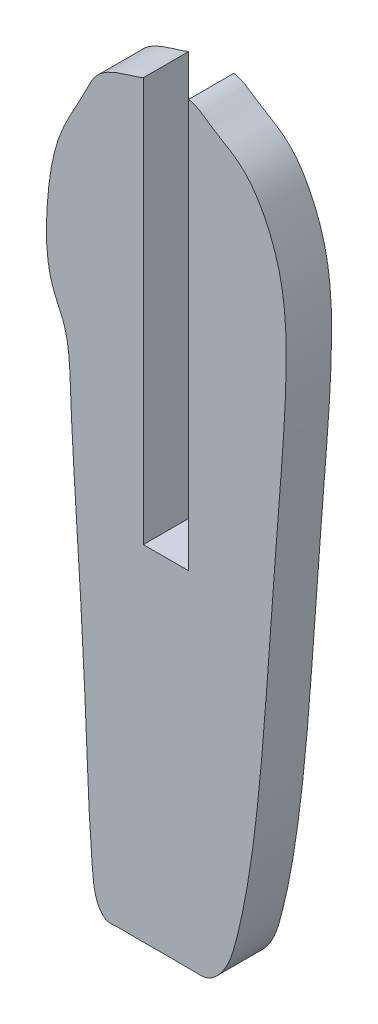
ISO-10303-21;
HEADER;
FILE_DESCRIPTION(('STEP AP214'),'2;1');
FILE_NAME('part.step','',(''),(''),'','','');
FILE_SCHEMA(('AUTOMOTIVE_DESIGN { 1 0 10303 214 1 1 1 1 }'));
ENDSEC;
DATA;
#1=APPLICATION_CONTEXT('core data for automotive mechanical design processes');
#2=APPLICATION_PROTOCOL_DEFINITION('international standard','automotive_design',2000,#1);
#3=PRODUCT_CONTEXT('',#1,'mechanical');
#4=PRODUCT('Part','Part','',(#3));
#5=PRODUCT_RELATED_PRODUCT_CATEGORY('part','',(#4));
#6=PRODUCT_DEFINITION_FORMATION('','',#4);
#7=PRODUCT_DEFINITION_CONTEXT('part definition',#1,'design');
#8=PRODUCT_DEFINITION('design','',#6,#7);
#9=PRODUCT_DEFINITION_SHAPE('','',#8);
#10=(LENGTH_UNIT() NAMED_UNIT(*) SI_UNIT(.MILLI.,.METRE.));
#11=(NAMED_UNIT(*) PLANE_ANGLE_UNIT() SI_UNIT($,.RADIAN.));
#12=(NAMED_UNIT(*) SI_UNIT($,.STERADIAN.) SOLID_ANGLE_UNIT());
#13=UNCERTAINTY_MEASURE_WITH_UNIT(LENGTH_MEASURE(1.E-05),#10,'distance_accuracy_value','');
#14=(GEOMETRIC_REPRESENTATION_CONTEXT(3) GLOBAL_UNCERTAINTY_ASSIGNED_CONTEXT((#13)) GLOBAL_UNIT_ASSIGNED_CONTEXT((#10,
#11,#12)) REPRESENTATION_CONTEXT('',''));
#15=CARTESIAN_POINT('',(0.,0.,0.));
#16=DIRECTION('',(0.,0.,1.));
#17=DIRECTION('',(1.,0.,0.));
#18=AXIS2_PLACEMENT_3D('',#15,#16,#17);
#19=CARTESIAN_POINT('',(0.,-33.4574468085106,3.));
#20=CARTESIAN_POINT('',(0.476348767302769,-33.4612247823282,3.));
#21=CARTESIAN_POINT('',(1.1176983493128,-33.4577393510762,3.));
#22=CARTESIAN_POINT('',(2.15503925955124,-33.4568910596859,3.));
#23=CARTESIAN_POINT('',(2.72816559040753,-33.4864696247628,3.));
#24=CARTESIAN_POINT('',(3.65743541335635,-33.4230162190586,3.));
#25=CARTESIAN_POINT('',(4.77562538195093,-32.3038594847888,3.));
#26=CARTESIAN_POINT('',(5.82092603679563,-28.7487394612256,3.));
#27=CARTESIAN_POINT('',(6.95842819985669,-21.3735511033142,3.));
#28=CARTESIAN_POINT('',(7.53437242776158,-11.8537262782267,3.));
#29=CARTESIAN_POINT('',(8.28110745463819,-2.67408545499112,3.));
#30=CARTESIAN_POINT('',(8.73391512506526,3.81896264099834,3.));
#31=CARTESIAN_POINT('',(8.55157388632817,8.67255674488477,3.));
#32=CARTESIAN_POINT('',(7.37462828310868,12.0629825252676,3.));
#33=CARTESIAN_POINT('',(5.77496878670363,14.3545765483316,3.));
#34=CARTESIAN_POINT('',(3.37996516012665,15.5593556143804,3.));
#35=CARTESIAN_POINT('',(2.96311853199113,16.0866273097871,3.));
#36=CARTESIAN_POINT('',(2.20000000000001,16.2798861410953,3.));
#37=B_SPLINE_CURVE_WITH_KNOTS('',3,(#19,#20,#21,#22,#23,#24,#25,#26,#27,#28,#29,#30,#31,#32,#33,
#34,#35,#36),.UNSPECIFIED.,.F.,.F.,(4,1,1,1,1,1,1,1,1,1,1,1,1,1,1,4),(0.0259345926958942,
0.0524415128520202,0.0577686580603061,0.0768241129211479,0.0819555049008668,0.10670064599989,
0.145840566481924,0.274335938690583,0.483714769232246,0.634600312495663,0.744507152818127,
0.816414004946962,0.881335872173313,0.923856158488981,0.959751805177799,1.),.UNSPECIFIED.);
#38=DIRECTION('',(0.,0.,-1.));
#39=VECTOR('',#38,1.);
#40=SURFACE_OF_LINEAR_EXTRUSION('',#37,#39);
#41=CARTESIAN_POINT('',(0.,-33.4574468085106,0.));
#42=CARTESIAN_POINT('',(0.476348767302769,-33.4612247823282,0.));
#43=CARTESIAN_POINT('',(1.1176983493128,-33.4577393510762,0.));
#44=CARTESIAN_POINT('',(2.15503925955124,-33.4568910596859,0.));
#45=CARTESIAN_POINT('',(2.72816559040753,-33.4864696247628,0.));
#46=CARTESIAN_POINT('',(3.65743541335635,-33.4230162190586,0.));
#47=CARTESIAN_POINT('',(4.77562538195093,-32.3038594847888,0.));
#48=CARTESIAN_POINT('',(5.82092603679563,-28.7487394612256,0.));
#49=CARTESIAN_POINT('',(6.95842819985669,-21.3735511033142,0.));
#50=CARTESIAN_POINT('',(7.53437242776158,-11.8537262782267,0.));
#51=CARTESIAN_POINT('',(8.28110745463819,-2.67408545499112,0.));
#52=CARTESIAN_POINT('',(8.73391512506526,3.81896264099834,0.));
#53=CARTESIAN_POINT('',(8.55157388632817,8.67255674488477,0.));
#54=CARTESIAN_POINT('',(7.37462828310868,12.0629825252676,0.));
#55=CARTESIAN_POINT('',(5.77496878670363,14.3545765483316,0.));
#56=CARTESIAN_POINT('',(3.37996516012665,15.5593556143804,0.));
#57=CARTESIAN_POINT('',(2.96311853199113,16.0866273097871,0.));
#58=CARTESIAN_POINT('',(2.20000000000001,16.2798861410953,0.));
#59=B_SPLINE_CURVE_WITH_KNOTS('',3,(#41,#42,#43,#44,#45,#46,#47,#48,#49,#50,#51,#52,#53,#54,#55,
#56,#57,#58),.UNSPECIFIED.,.F.,.F.,(4,1,1,1,1,1,1,1,1,1,1,1,1,1,1,4),(0.0259345926958942,
0.0524415128520202,0.0577686580603061,0.0768241129211479,0.0819555049008668,0.10670064599989,
0.145840566481924,0.274335938690583,0.483714769232246,0.634600312495663,0.744507152818127,
0.816414004946962,0.881335872173313,0.923856158488981,0.959751805177799,1.),.UNSPECIFIED.);
#60=CARTESIAN_POINT('',(0.,-33.4574468085106,0.));
#61=VERTEX_POINT('',#60);
#62=CARTESIAN_POINT('',(2.20000000000001,16.2798861410953,0.));
#63=VERTEX_POINT('',#62);
#64=EDGE_CURVE('E111',#61,#63,#59,.T.);
#65=ORIENTED_EDGE('',*,*,#64,.T.);
#66=DIRECTION('',(0.,0.,-1.));
#67=VECTOR('',#66,1.);
#68=CARTESIAN_POINT('',(2.20000000000001,16.2798861410953,3.));
#69=LINE('',#68,#67);
#70=CARTESIAN_POINT('',(2.20000000000001,16.2798861410953,3.));
#71=VERTEX_POINT('',#70);
#72=EDGE_CURVE('E11',#71,#63,#69,.T.);
#73=ORIENTED_EDGE('',*,*,#72,.F.);
#74=CARTESIAN_POINT('',(0.,-33.4574468085106,3.));
#75=VERTEX_POINT('',#74);
#76=EDGE_CURVE('E145',#75,#71,#37,.T.);
#77=ORIENTED_EDGE('',*,*,#76,.F.);
#78=DIRECTION('',(0.,0.,-1.));
#79=VECTOR('',#78,1.);
#80=CARTESIAN_POINT('',(0.,-33.4574468085106,3.));
#81=LINE('',#80,#79);
#82=EDGE_CURVE('E104',#75,#61,#81,.T.);
#83=ORIENTED_EDGE('',*,*,#82,.T.);
#84=EDGE_LOOP('',(#65,#73,#77,#83));
#85=FACE_BOUND('',#84,.T.);
#86=ADVANCED_FACE('F33',(#85),#40,.F.);
#87=CARTESIAN_POINT('',(2.20000000000001,16.2798861410953,3.));
#88=DIRECTION('',(1.,0.,0.));
#89=DIRECTION('',(0.,1.,0.));
#90=AXIS2_PLACEMENT_3D('',#87,#88,#89);
#91=PLANE('',#90);
#92=DIRECTION('',(0.,-1.,0.));
#93=VECTOR('',#92,1.);
#94=CARTESIAN_POINT('',(2.20000000000001,16.2798861410953,0.));
#95=LINE('',#94,#93);
#96=CARTESIAN_POINT('',(2.20000000000001,-10.7087610491027,0.));
#97=VERTEX_POINT('',#96);
#98=EDGE_CURVE('E134',#63,#97,#95,.T.);
#99=ORIENTED_EDGE('',*,*,#98,.T.);
#100=DIRECTION('',(0.,0.,-1.));
#101=VECTOR('',#100,1.);
#102=CARTESIAN_POINT('',(2.20000000000001,-10.7087610491027,3.));
#103=LINE('',#102,#101);
#104=CARTESIAN_POINT('',(2.20000000000001,-10.7087610491027,3.));
#105=VERTEX_POINT('',#104);
#106=EDGE_CURVE('E42',#105,#97,#103,.T.);
#107=ORIENTED_EDGE('',*,*,#106,.F.);
#108=DIRECTION('',(0.,-1.,0.));
#109=VECTOR('',#108,1.);
#110=CARTESIAN_POINT('',(2.20000000000001,16.2798861410953,3.));
#111=LINE('',#110,#109);
#112=EDGE_CURVE('E84',#71,#105,#111,.T.);
#113=ORIENTED_EDGE('',*,*,#112,.F.);
#114=ORIENTED_EDGE('',*,*,#72,.T.);
#115=EDGE_LOOP('',(#99,#107,#113,#114));
#116=FACE_BOUND('',#115,.T.);
#117=ADVANCED_FACE('F128',(#116),#91,.F.);
#118=CARTESIAN_POINT('',(2.20000000000001,-10.7087610491027,3.));
#119=DIRECTION('',(0.,-1.,0.));
#120=DIRECTION('',(0.,0.,-1.));
#121=AXIS2_PLACEMENT_3D('',#118,#119,#120);
#122=PLANE('',#121);
#123=DIRECTION('',(-1.,0.,0.));
#124=VECTOR('',#123,1.);
#125=CARTESIAN_POINT('',(2.20000000000001,-10.7087610491027,0.));
#126=LINE('',#125,#124);
#127=CARTESIAN_POINT('',(-0.799999999999994,-10.7087610491027,0.));
#128=VERTEX_POINT('',#127);
#129=EDGE_CURVE('E99',#97,#128,#126,.T.);
#130=ORIENTED_EDGE('',*,*,#129,.T.);
#131=DIRECTION('',(0.,0.,-1.));
#132=VECTOR('',#131,1.);
#133=CARTESIAN_POINT('',(-0.799999999999994,-10.7087610491027,3.));
#134=LINE('',#133,#132);
#135=CARTESIAN_POINT('',(-0.799999999999994,-10.7087610491027,3.));
#136=VERTEX_POINT('',#135);
#137=EDGE_CURVE('E96',#136,#128,#134,.T.);
#138=ORIENTED_EDGE('',*,*,#137,.F.);
#139=DIRECTION('',(-1.,0.,0.));
#140=VECTOR('',#139,1.);
#141=CARTESIAN_POINT('',(2.20000000000001,-10.7087610491027,3.));
#142=LINE('',#141,#140);
#143=EDGE_CURVE('E88',#105,#136,#142,.T.);
#144=ORIENTED_EDGE('',*,*,#143,.F.);
#145=ORIENTED_EDGE('',*,*,#106,.T.);
#146=EDGE_LOOP('',(#130,#138,#144,#145));
#147=FACE_BOUND('',#146,.T.);
#148=ADVANCED_FACE('F97',(#147),#122,.F.);
#149=CARTESIAN_POINT('',(-0.799999999999994,-10.7087610491027,3.));
#150=DIRECTION('',(-1.,0.,0.));
#151=DIRECTION('',(0.,0.,1.));
#152=AXIS2_PLACEMENT_3D('',#149,#150,#151);
#153=PLANE('',#152);
#154=DIRECTION('',(0.,1.,0.));
#155=VECTOR('',#154,1.);
#156=CARTESIAN_POINT('',(-0.799999999999994,-10.7087610491027,0.));
#157=LINE('',#156,#155);
#158=CARTESIAN_POINT('',(-0.799999999999994,16.0185811023616,0.));
#159=VERTEX_POINT('',#158);
#160=EDGE_CURVE('E70',#128,#159,#157,.T.);
#161=ORIENTED_EDGE('',*,*,#160,.T.);
#162=DIRECTION('',(0.,0.,-1.));
#163=VECTOR('',#162,1.);
#164=CARTESIAN_POINT('',(-0.799999999999994,16.0185811023616,3.));
#165=LINE('',#164,#163);
#166=CARTESIAN_POINT('',(-0.799999999999994,16.0185811023616,3.));
#167=VERTEX_POINT('',#166);
#168=EDGE_CURVE('E100',#167,#159,#165,.T.);
#169=ORIENTED_EDGE('',*,*,#168,.F.);
#170=DIRECTION('',(0.,1.,0.));
#171=VECTOR('',#170,1.);
#172=CARTESIAN_POINT('',(-0.799999999999994,-10.7087610491027,3.));
#173=LINE('',#172,#171);
#174=EDGE_CURVE('E92',#136,#167,#173,.T.);
#175=ORIENTED_EDGE('',*,*,#174,.F.);
#176=ORIENTED_EDGE('',*,*,#137,.T.);
#177=EDGE_LOOP('',(#161,#169,#175,#176));
#178=FACE_BOUND('',#177,.T.);
#179=ADVANCED_FACE('F102',(#178),#153,.F.);
#180=CARTESIAN_POINT('',(-0.799999999999994,16.0185811023616,3.));
#181=CARTESIAN_POINT('',(-1.13747886836467,15.856785997049,3.));
#182=CARTESIAN_POINT('',(-3.86496892757496,15.1866053329434,3.));
#183=CARTESIAN_POINT('',(-4.46434574190813,13.3770219147037,3.));
#184=CARTESIAN_POINT('',(-6.53048239301621,10.1604946445765,3.));
#185=CARTESIAN_POINT('',(-7.09628317577196,6.81545614126418,3.));
#186=CARTESIAN_POINT('',(-7.27673344555765,3.64996002874281,3.));
#187=CARTESIAN_POINT('',(-7.01026939846662,1.22207344535776,3.));
#188=CARTESIAN_POINT('',(-6.03857588775107,-0.500882296728355,3.));
#189=CARTESIAN_POINT('',(-5.67231537393509,-2.24841790875321,3.));
#190=CARTESIAN_POINT('',(-5.57604990103804,-5.96414366824389,3.));
#191=CARTESIAN_POINT('',(-5.12130196910531,-12.7482248871357,3.));
#192=CARTESIAN_POINT('',(-4.58695894064424,-21.7776768656014,3.));
#193=CARTESIAN_POINT('',(-4.39832374762056,-28.5425563165297,3.));
#194=CARTESIAN_POINT('',(-4.01051322097913,-32.4939682558477,3.));
#195=CARTESIAN_POINT('',(-3.49287857583255,-33.5811798853354,3.));
#196=CARTESIAN_POINT('',(-2.48219226750682,-33.4322900300388,3.));
#197=CARTESIAN_POINT('',(-1.97549097245365,-33.45361621554,3.));
#198=CARTESIAN_POINT('',(-1.14300381807501,-33.4665525346081,3.));
#199=CARTESIAN_POINT('',(-0.59611319228943,-33.4776102309238,3.));
#200=CARTESIAN_POINT('',(0.,-33.4574468085106,3.));
#201=B_SPLINE_CURVE_WITH_KNOTS('',3,(#180,#181,#182,#183,#184,#185,#186,#187,#188,#189,#190,
#191,#192,#193,#194,#195,#196,#197,#198,#199,#200),.UNSPECIFIED.,.F.,.F.,(4,1,1,1,1,1,1,1,1,1,1,
1,1,1,1,1,1,1,4),(0.0272532463485994,0.0465589411504237,0.0963849330344887,0.158729392728825,
0.22818560391023,0.271981862516655,0.323080185279998,0.351299809078383,0.373137696715846,
0.414663231050136,0.543428446795852,0.725126088508359,0.882497071981521,0.894014183003315,
0.929959463539118,0.943400874248894,0.960682688018606,0.966342600593716,1.),.UNSPECIFIED.);
#202=DIRECTION('',(0.,0.,-1.));
#203=VECTOR('',#202,1.);
#204=SURFACE_OF_LINEAR_EXTRUSION('',#201,#203);
#205=CARTESIAN_POINT('',(-0.799999999999994,16.0185811023616,0.));
#206=CARTESIAN_POINT('',(-1.13747886836467,15.856785997049,0.));
#207=CARTESIAN_POINT('',(-3.86496892757496,15.1866053329434,0.));
#208=CARTESIAN_POINT('',(-4.46434574190813,13.3770219147037,0.));
#209=CARTESIAN_POINT('',(-6.53048239301621,10.1604946445765,0.));
#210=CARTESIAN_POINT('',(-7.09628317577196,6.81545614126418,0.));
#211=CARTESIAN_POINT('',(-7.27673344555765,3.64996002874281,0.));
#212=CARTESIAN_POINT('',(-7.01026939846662,1.22207344535776,0.));
#213=CARTESIAN_POINT('',(-6.03857588775107,-0.500882296728355,0.));
#214=CARTESIAN_POINT('',(-5.67231537393509,-2.24841790875321,0.));
#215=CARTESIAN_POINT('',(-5.57604990103804,-5.96414366824389,0.));
#216=CARTESIAN_POINT('',(-5.12130196910531,-12.7482248871357,0.));
#217=CARTESIAN_POINT('',(-4.58695894064424,-21.7776768656014,0.));
#218=CARTESIAN_POINT('',(-4.39832374762056,-28.5425563165297,0.));
#219=CARTESIAN_POINT('',(-4.01051322097913,-32.4939682558477,0.));
#220=CARTESIAN_POINT('',(-3.49287857583255,-33.5811798853354,0.));
#221=CARTESIAN_POINT('',(-2.48219226750682,-33.4322900300388,0.));
#222=CARTESIAN_POINT('',(-1.97549097245365,-33.45361621554,0.));
#223=CARTESIAN_POINT('',(-1.14300381807501,-33.4665525346081,0.));
#224=CARTESIAN_POINT('',(-0.59611319228943,-33.4776102309238,0.));
#225=CARTESIAN_POINT('',(0.,-33.4574468085106,0.));
#226=B_SPLINE_CURVE_WITH_KNOTS('',3,(#205,#206,#207,#208,#209,#210,#211,#212,#213,#214,#215,
#216,#217,#218,#219,#220,#221,#222,#223,#224,#225),.UNSPECIFIED.,.F.,.F.,(4,1,1,1,1,1,1,1,1,1,1,
1,1,1,1,1,1,1,4),(0.0272532463485994,0.0465589411504237,0.0963849330344887,0.158729392728825,
0.22818560391023,0.271981862516655,0.323080185279998,0.351299809078383,0.373137696715846,
0.414663231050136,0.543428446795852,0.725126088508359,0.882497071981521,0.894014183003315,
0.929959463539118,0.943400874248894,0.960682688018606,0.966342600593716,1.),.UNSPECIFIED.);
#227=EDGE_CURVE('E76',#159,#61,#226,.T.);
#228=ORIENTED_EDGE('',*,*,#227,.T.);
#229=ORIENTED_EDGE('',*,*,#82,.F.);
#230=EDGE_CURVE('E50',#167,#75,#201,.T.);
#231=ORIENTED_EDGE('',*,*,#230,.F.);
#232=ORIENTED_EDGE('',*,*,#168,.T.);
#233=EDGE_LOOP('',(#228,#229,#231,#232));
#234=FACE_BOUND('',#233,.T.);
#235=ADVANCED_FACE('F119',(#234),#204,.F.);
#236=CARTESIAN_POINT('',(7.78007386676146,-8.99678349148778,3.));
#237=DIRECTION('',(0.,0.,1.));
#238=DIRECTION('',(1.,0.,0.));
#239=AXIS2_PLACEMENT_3D('',#236,#237,#238);
#240=PLANE('',#239);
#241=ORIENTED_EDGE('',*,*,#76,.T.);
#242=ORIENTED_EDGE('',*,*,#112,.T.);
#243=ORIENTED_EDGE('',*,*,#143,.T.);
#244=ORIENTED_EDGE('',*,*,#174,.T.);
#245=ORIENTED_EDGE('',*,*,#230,.T.);
#246=EDGE_LOOP('',(#241,#242,#243,#244,#245));
#247=FACE_BOUND('',#246,.T.);
#248=ADVANCED_FACE('F90',(#247),#240,.T.);
#249=CARTESIAN_POINT('',(7.78007386676146,-8.99678349148778,0.));
#250=DIRECTION('',(0.,0.,1.));
#251=DIRECTION('',(1.,0.,0.));
#252=AXIS2_PLACEMENT_3D('',#249,#250,#251);
#253=PLANE('',#252);
#254=ORIENTED_EDGE('',*,*,#64,.F.);
#255=ORIENTED_EDGE('',*,*,#227,.F.);
#256=ORIENTED_EDGE('',*,*,#160,.F.);
#257=ORIENTED_EDGE('',*,*,#129,.F.);
#258=ORIENTED_EDGE('',*,*,#98,.F.);
#259=EDGE_LOOP('',(#254,#255,#256,#257,#258));
#260=FACE_BOUND('',#259,.T.);
#261=ADVANCED_FACE('F123',(#260),#253,.F.);
#262=CLOSED_SHELL('',(#86,#117,#148,#179,#235,#248,#261));
#263=MANIFOLD_SOLID_BREP('B2',#262);
#264=ADVANCED_BREP_SHAPE_REPRESENTATION('',(#18,#263),#14);
#265=SHAPE_DEFINITION_REPRESENTATION(#9,#264);
ENDSEC;
END-ISO-10303-21;
